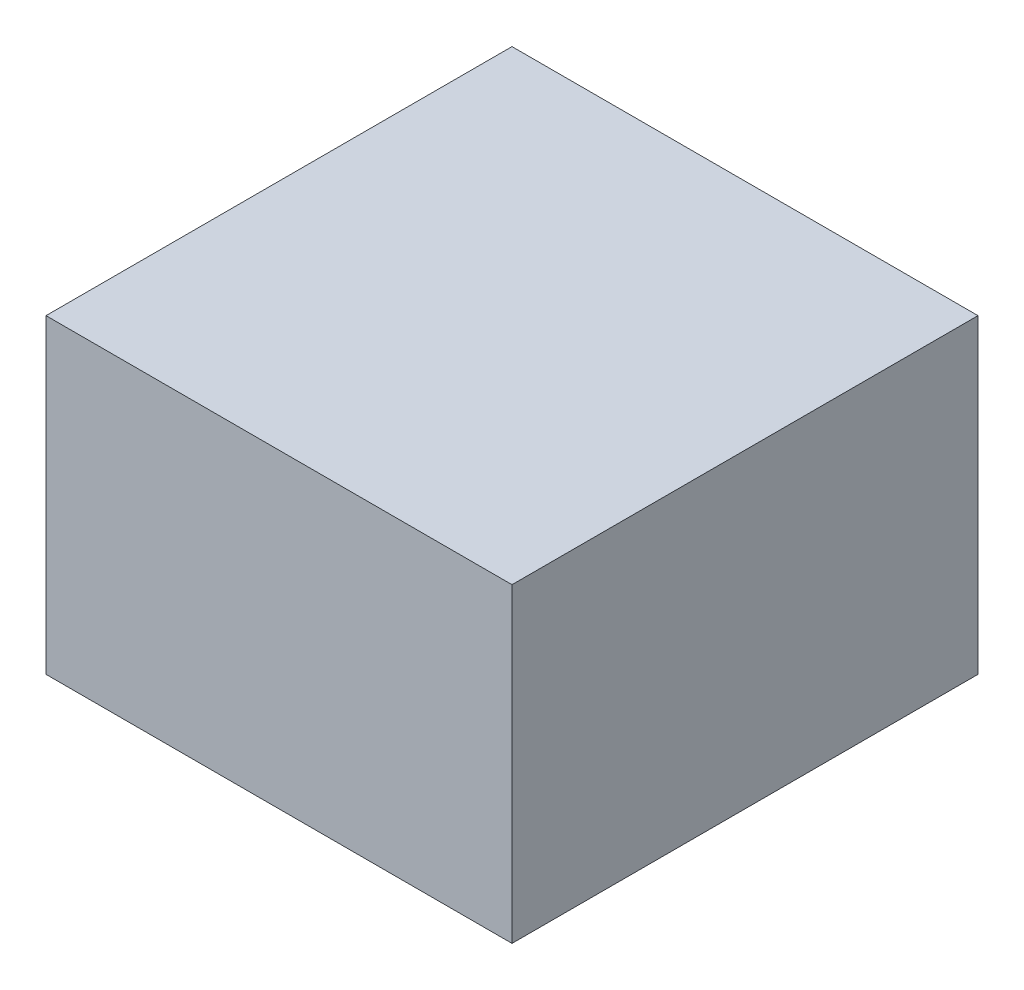
ISO-10303-21;
HEADER;
FILE_DESCRIPTION(('STEP AP214'),'2;1');
FILE_NAME('part.step','',(''),(''),'','','');
FILE_SCHEMA(('AUTOMOTIVE_DESIGN { 1 0 10303 214 1 1 1 1 }'));
ENDSEC;
DATA;
#1=APPLICATION_CONTEXT('core data for automotive mechanical design processes');
#2=APPLICATION_PROTOCOL_DEFINITION('international standard','automotive_design',2000,#1);
#3=PRODUCT_CONTEXT('',#1,'mechanical');
#4=PRODUCT('Part','Part','',(#3));
#5=PRODUCT_RELATED_PRODUCT_CATEGORY('part','',(#4));
#6=PRODUCT_DEFINITION_FORMATION('','',#4);
#7=PRODUCT_DEFINITION_CONTEXT('part definition',#1,'design');
#8=PRODUCT_DEFINITION('design','',#6,#7);
#9=PRODUCT_DEFINITION_SHAPE('','',#8);
#10=(LENGTH_UNIT() NAMED_UNIT(*) SI_UNIT(.MILLI.,.METRE.));
#11=(NAMED_UNIT(*) PLANE_ANGLE_UNIT() SI_UNIT($,.RADIAN.));
#12=(NAMED_UNIT(*) SI_UNIT($,.STERADIAN.) SOLID_ANGLE_UNIT());
#13=UNCERTAINTY_MEASURE_WITH_UNIT(LENGTH_MEASURE(1.E-05),#10,'distance_accuracy_value','');
#14=(GEOMETRIC_REPRESENTATION_CONTEXT(3) GLOBAL_UNCERTAINTY_ASSIGNED_CONTEXT((#13)) GLOBAL_UNIT_ASSIGNED_CONTEXT((#10,
#11,#12)) REPRESENTATION_CONTEXT('',''));
#15=CARTESIAN_POINT('',(0.,0.,0.));
#16=DIRECTION('',(0.,0.,1.));
#17=DIRECTION('',(1.,0.,0.));
#18=AXIS2_PLACEMENT_3D('',#15,#16,#17);
#19=CARTESIAN_POINT('',(15.,20.,-15.));
#20=DIRECTION('',(-1.,0.,0.));
#21=DIRECTION('',(0.,0.,1.));
#22=AXIS2_PLACEMENT_3D('',#19,#20,#21);
#23=PLANE('',#22);
#24=DIRECTION('',(0.,0.,-1.));
#25=VECTOR('',#24,1.);
#26=CARTESIAN_POINT('',(15.,0.,-15.));
#27=LINE('',#26,#25);
#28=CARTESIAN_POINT('',(15.,0.,15.));
#29=VERTEX_POINT('',#28);
#30=CARTESIAN_POINT('',(15.,0.,-15.));
#31=VERTEX_POINT('',#30);
#32=EDGE_CURVE('E101',#29,#31,#27,.T.);
#33=ORIENTED_EDGE('',*,*,#32,.T.);
#34=DIRECTION('',(0.,-1.,0.));
#35=VECTOR('',#34,1.);
#36=CARTESIAN_POINT('',(15.,20.,-15.));
#37=LINE('',#36,#35);
#38=CARTESIAN_POINT('',(15.,20.,-15.));
#39=VERTEX_POINT('',#38);
#40=EDGE_CURVE('E11',#39,#31,#37,.T.);
#41=ORIENTED_EDGE('',*,*,#40,.F.);
#42=DIRECTION('',(0.,0.,-1.));
#43=VECTOR('',#42,1.);
#44=CARTESIAN_POINT('',(15.,20.,-15.));
#45=LINE('',#44,#43);
#46=CARTESIAN_POINT('',(15.,20.,15.));
#47=VERTEX_POINT('',#46);
#48=EDGE_CURVE('E89',#47,#39,#45,.T.);
#49=ORIENTED_EDGE('',*,*,#48,.F.);
#50=DIRECTION('',(0.,-1.,0.));
#51=VECTOR('',#50,1.);
#52=CARTESIAN_POINT('',(15.,20.,15.));
#53=LINE('',#52,#51);
#54=EDGE_CURVE('E97',#47,#29,#53,.T.);
#55=ORIENTED_EDGE('',*,*,#54,.T.);
#56=EDGE_LOOP('',(#33,#41,#49,#55));
#57=FACE_BOUND('',#56,.T.);
#58=ADVANCED_FACE('F38',(#57),#23,.F.);
#59=CARTESIAN_POINT('',(-15.,20.,-15.));
#60=DIRECTION('',(0.,0.,1.));
#61=DIRECTION('',(1.,0.,0.));
#62=AXIS2_PLACEMENT_3D('',#59,#60,#61);
#63=PLANE('',#62);
#64=DIRECTION('',(-1.,0.,0.));
#65=VECTOR('',#64,1.);
#66=CARTESIAN_POINT('',(-15.,0.,-15.));
#67=LINE('',#66,#65);
#68=CARTESIAN_POINT('',(-15.,0.,-15.));
#69=VERTEX_POINT('',#68);
#70=EDGE_CURVE('E93',#31,#69,#67,.T.);
#71=ORIENTED_EDGE('',*,*,#70,.T.);
#72=DIRECTION('',(0.,-1.,0.));
#73=VECTOR('',#72,1.);
#74=CARTESIAN_POINT('',(-15.,20.,-15.));
#75=LINE('',#74,#73);
#76=CARTESIAN_POINT('',(-15.,20.,-15.));
#77=VERTEX_POINT('',#76);
#78=EDGE_CURVE('E46',#77,#69,#75,.T.);
#79=ORIENTED_EDGE('',*,*,#78,.F.);
#80=DIRECTION('',(-1.,0.,0.));
#81=VECTOR('',#80,1.);
#82=CARTESIAN_POINT('',(-15.,20.,-15.));
#83=LINE('',#82,#81);
#84=EDGE_CURVE('E84',#39,#77,#83,.T.);
#85=ORIENTED_EDGE('',*,*,#84,.F.);
#86=ORIENTED_EDGE('',*,*,#40,.T.);
#87=EDGE_LOOP('',(#71,#79,#85,#86));
#88=FACE_BOUND('',#87,.T.);
#89=ADVANCED_FACE('F92',(#88),#63,.F.);
#90=CARTESIAN_POINT('',(-15.,20.,-15.));
#91=DIRECTION('',(1.,0.,0.));
#92=DIRECTION('',(0.,0.,-1.));
#93=AXIS2_PLACEMENT_3D('',#90,#91,#92);
#94=PLANE('',#93);
#95=DIRECTION('',(0.,0.,1.));
#96=VECTOR('',#95,1.);
#97=CARTESIAN_POINT('',(-15.,0.,-15.));
#98=LINE('',#97,#96);
#99=CARTESIAN_POINT('',(-15.,0.,15.));
#100=VERTEX_POINT('',#99);
#101=EDGE_CURVE('E71',#69,#100,#98,.T.);
#102=ORIENTED_EDGE('',*,*,#101,.T.);
#103=DIRECTION('',(0.,-1.,0.));
#104=VECTOR('',#103,1.);
#105=CARTESIAN_POINT('',(-15.,20.,15.));
#106=LINE('',#105,#104);
#107=CARTESIAN_POINT('',(-15.,20.,15.));
#108=VERTEX_POINT('',#107);
#109=EDGE_CURVE('E94',#108,#100,#106,.T.);
#110=ORIENTED_EDGE('',*,*,#109,.F.);
#111=DIRECTION('',(0.,0.,1.));
#112=VECTOR('',#111,1.);
#113=CARTESIAN_POINT('',(-15.,20.,-15.));
#114=LINE('',#113,#112);
#115=EDGE_CURVE('E87',#77,#108,#114,.T.);
#116=ORIENTED_EDGE('',*,*,#115,.F.);
#117=ORIENTED_EDGE('',*,*,#78,.T.);
#118=EDGE_LOOP('',(#102,#110,#116,#117));
#119=FACE_BOUND('',#118,.T.);
#120=ADVANCED_FACE('F95',(#119),#94,.F.);
#121=CARTESIAN_POINT('',(-15.,20.,15.));
#122=DIRECTION('',(0.,0.,-1.));
#123=DIRECTION('',(-1.,0.,0.));
#124=AXIS2_PLACEMENT_3D('',#121,#122,#123);
#125=PLANE('',#124);
#126=DIRECTION('',(1.,0.,0.));
#127=VECTOR('',#126,1.);
#128=CARTESIAN_POINT('',(-15.,0.,15.));
#129=LINE('',#128,#127);
#130=EDGE_CURVE('E77',#100,#29,#129,.T.);
#131=ORIENTED_EDGE('',*,*,#130,.T.);
#132=ORIENTED_EDGE('',*,*,#54,.F.);
#133=DIRECTION('',(1.,0.,0.));
#134=VECTOR('',#133,1.);
#135=CARTESIAN_POINT('',(-15.,20.,15.));
#136=LINE('',#135,#134);
#137=EDGE_CURVE('E54',#108,#47,#136,.T.);
#138=ORIENTED_EDGE('',*,*,#137,.F.);
#139=ORIENTED_EDGE('',*,*,#109,.T.);
#140=EDGE_LOOP('',(#131,#132,#138,#139));
#141=FACE_BOUND('',#140,.T.);
#142=ADVANCED_FACE('F108',(#141),#125,.F.);
#143=CARTESIAN_POINT('',(0.,20.,0.));
#144=DIRECTION('',(0.,1.,0.));
#145=DIRECTION('',(0.,0.,1.));
#146=AXIS2_PLACEMENT_3D('',#143,#144,#145);
#147=PLANE('',#146);
#148=ORIENTED_EDGE('',*,*,#48,.T.);
#149=ORIENTED_EDGE('',*,*,#84,.T.);
#150=ORIENTED_EDGE('',*,*,#115,.T.);
#151=ORIENTED_EDGE('',*,*,#137,.T.);
#152=EDGE_LOOP('',(#148,#149,#150,#151));
#153=FACE_BOUND('',#152,.T.);
#154=ADVANCED_FACE('F85',(#153),#147,.T.);
#155=CARTESIAN_POINT('',(0.,0.,0.));
#156=DIRECTION('',(0.,1.,0.));
#157=DIRECTION('',(0.,0.,1.));
#158=AXIS2_PLACEMENT_3D('',#155,#156,#157);
#159=PLANE('',#158);
#160=ORIENTED_EDGE('',*,*,#32,.F.);
#161=ORIENTED_EDGE('',*,*,#130,.F.);
#162=ORIENTED_EDGE('',*,*,#101,.F.);
#163=ORIENTED_EDGE('',*,*,#70,.F.);
#164=EDGE_LOOP('',(#160,#161,#162,#163));
#165=FACE_BOUND('',#164,.T.);
#166=ADVANCED_FACE('F111',(#165),#159,.F.);
#167=CLOSED_SHELL('',(#58,#89,#120,#142,#154,#166));
#168=MANIFOLD_SOLID_BREP('B2',#167);
#169=ADVANCED_BREP_SHAPE_REPRESENTATION('',(#18,#168),#14);
#170=SHAPE_DEFINITION_REPRESENTATION(#9,#169);
ENDSEC;
END-ISO-10303-21;
